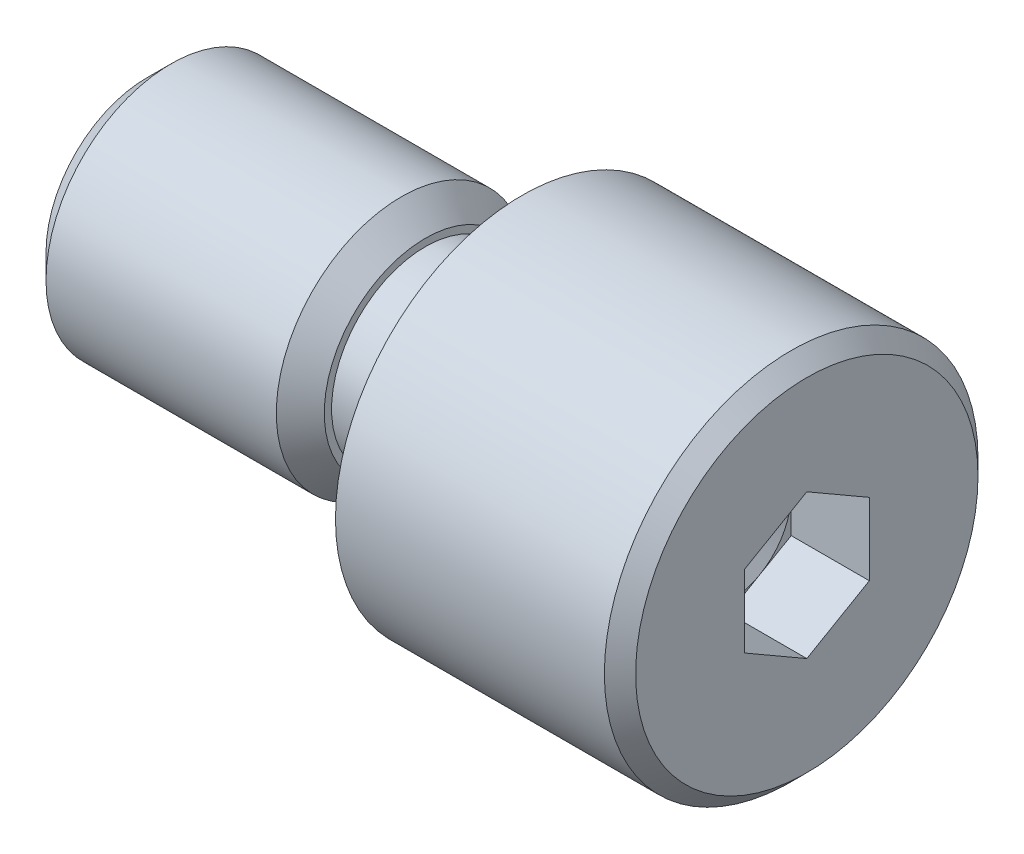
ISO-10303-21;
HEADER;
FILE_DESCRIPTION(('STEP AP214'),'2;1');
FILE_NAME('part.step','',(''),(''),'','','');
FILE_SCHEMA(('AUTOMOTIVE_DESIGN { 1 0 10303 214 1 1 1 1 }'));
ENDSEC;
DATA;
#1=APPLICATION_CONTEXT('core data for automotive mechanical design processes');
#2=APPLICATION_PROTOCOL_DEFINITION('international standard','automotive_design',2000,#1);
#3=PRODUCT_CONTEXT('',#1,'mechanical');
#4=PRODUCT('Part','Part','',(#3));
#5=PRODUCT_RELATED_PRODUCT_CATEGORY('part','',(#4));
#6=PRODUCT_DEFINITION_FORMATION('','',#4);
#7=PRODUCT_DEFINITION_CONTEXT('part definition',#1,'design');
#8=PRODUCT_DEFINITION('design','',#6,#7);
#9=PRODUCT_DEFINITION_SHAPE('','',#8);
#10=(LENGTH_UNIT() NAMED_UNIT(*) SI_UNIT(.MILLI.,.METRE.));
#11=(NAMED_UNIT(*) PLANE_ANGLE_UNIT() SI_UNIT($,.RADIAN.));
#12=(NAMED_UNIT(*) SI_UNIT($,.STERADIAN.) SOLID_ANGLE_UNIT());
#13=UNCERTAINTY_MEASURE_WITH_UNIT(LENGTH_MEASURE(1.E-05),#10,'distance_accuracy_value','');
#14=(GEOMETRIC_REPRESENTATION_CONTEXT(3) GLOBAL_UNCERTAINTY_ASSIGNED_CONTEXT((#13)) GLOBAL_UNIT_ASSIGNED_CONTEXT((#10,
#11,#12)) REPRESENTATION_CONTEXT('',''));
#15=CARTESIAN_POINT('',(0.,0.,0.));
#16=DIRECTION('',(0.,0.,1.));
#17=DIRECTION('',(1.,0.,0.));
#18=AXIS2_PLACEMENT_3D('',#15,#16,#17);
#19=CARTESIAN_POINT('',(18.6,0.,0.));
#20=DIRECTION('',(1.,0.,0.));
#21=DIRECTION('',(0.,0.,-1.));
#22=AXIS2_PLACEMENT_3D('',#19,#20,#21);
#23=PLANE('',#22);
#24=DIRECTION('',(0.,-1.,0.));
#25=VECTOR('',#24,1.);
#26=CARTESIAN_POINT('',(18.6,1.1547005383793,2.));
#27=LINE('',#26,#25);
#28=CARTESIAN_POINT('',(18.6,1.1547005383793,2.));
#29=VERTEX_POINT('',#28);
#30=CARTESIAN_POINT('',(18.6000000000002,0.,2.));
#31=VERTEX_POINT('',#30);
#32=EDGE_CURVE('E266',#29,#31,#27,.T.);
#33=ORIENTED_EDGE('',*,*,#32,.T.);
#34=CARTESIAN_POINT('',(18.6000000000002,0.,0.));
#35=DIRECTION('',(-1.,0.,0.));
#36=DIRECTION('',(0.,0.,1.));
#37=AXIS2_PLACEMENT_3D('',#34,#35,#36);
#38=CIRCLE('',#37,1.99999999999989);
#39=CARTESIAN_POINT('',(18.6000000000002,1.7320508075688,0.999999999999912));
#40=VERTEX_POINT('',#39);
#41=EDGE_CURVE('E51',#31,#40,#38,.T.);
#42=ORIENTED_EDGE('',*,*,#41,.T.);
#43=DIRECTION('',(0.,-0.499999999999983,0.866025403784448));
#44=VECTOR('',#43,1.);
#45=CARTESIAN_POINT('',(18.6,2.3094010767585,0.));
#46=LINE('',#45,#44);
#47=EDGE_CURVE('E298',#40,#29,#46,.T.);
#48=ORIENTED_EDGE('',*,*,#47,.T.);
#49=EDGE_LOOP('',(#33,#42,#48));
#50=FACE_BOUND('',#49,.T.);
#51=ADVANCED_FACE('F36',(#50),#23,.T.);
#52=CARTESIAN_POINT('',(18.6,2.3094010767585,0.));
#53=VERTEX_POINT('',#52);
#54=EDGE_CURVE('E294',#53,#40,#46,.T.);
#55=ORIENTED_EDGE('',*,*,#54,.T.);
#56=CARTESIAN_POINT('',(18.6000000000002,1.7320508075688,-0.999999999999912));
#57=VERTEX_POINT('',#56);
#58=EDGE_CURVE('E239',#40,#57,#38,.T.);
#59=ORIENTED_EDGE('',*,*,#58,.T.);
#60=DIRECTION('',(0.,0.499999999999983,0.866025403784448));
#61=VECTOR('',#60,1.);
#62=CARTESIAN_POINT('',(18.6,1.1547005383793,-2.));
#63=LINE('',#62,#61);
#64=EDGE_CURVE('E304',#57,#53,#63,.T.);
#65=ORIENTED_EDGE('',*,*,#64,.T.);
#66=EDGE_LOOP('',(#55,#59,#65));
#67=FACE_BOUND('',#66,.T.);
#68=ADVANCED_FACE('F126',(#67),#23,.T.);
#69=CARTESIAN_POINT('',(18.6,1.1547005383793,-2.));
#70=VERTEX_POINT('',#69);
#71=EDGE_CURVE('E300',#70,#57,#63,.T.);
#72=ORIENTED_EDGE('',*,*,#71,.T.);
#73=CARTESIAN_POINT('',(18.6000000000002,0.,-1.99999999999989));
#74=VERTEX_POINT('',#73);
#75=EDGE_CURVE('E253',#57,#74,#38,.T.);
#76=ORIENTED_EDGE('',*,*,#75,.T.);
#77=DIRECTION('',(0.,1.,0.));
#78=VECTOR('',#77,1.);
#79=CARTESIAN_POINT('',(18.6,-1.1547005383793,-2.));
#80=LINE('',#79,#78);
#81=EDGE_CURVE('E308',#74,#70,#80,.T.);
#82=ORIENTED_EDGE('',*,*,#81,.T.);
#83=EDGE_LOOP('',(#72,#76,#82));
#84=FACE_BOUND('',#83,.T.);
#85=ADVANCED_FACE('F131',(#84),#23,.T.);
#86=CARTESIAN_POINT('',(18.6,-1.1547005383793,-2.));
#87=VERTEX_POINT('',#86);
#88=EDGE_CURVE('E305',#87,#74,#80,.T.);
#89=ORIENTED_EDGE('',*,*,#88,.T.);
#90=CARTESIAN_POINT('',(18.6000000000002,-1.7320508075688,-0.999999999999912));
#91=VERTEX_POINT('',#90);
#92=EDGE_CURVE('E257',#74,#91,#38,.T.);
#93=ORIENTED_EDGE('',*,*,#92,.T.);
#94=DIRECTION('',(0.,0.499999999999983,-0.866025403784448));
#95=VECTOR('',#94,1.);
#96=CARTESIAN_POINT('',(18.6,-2.3094010767585,0.));
#97=LINE('',#96,#95);
#98=EDGE_CURVE('E311',#91,#87,#97,.T.);
#99=ORIENTED_EDGE('',*,*,#98,.T.);
#100=EDGE_LOOP('',(#89,#93,#99));
#101=FACE_BOUND('',#100,.T.);
#102=ADVANCED_FACE('F322',(#101),#23,.T.);
#103=CARTESIAN_POINT('',(18.6,-2.3094010767585,0.));
#104=VERTEX_POINT('',#103);
#105=EDGE_CURVE('E309',#104,#91,#97,.T.);
#106=ORIENTED_EDGE('',*,*,#105,.T.);
#107=CARTESIAN_POINT('',(18.6000000000002,-1.7320508075688,0.999999999999912));
#108=VERTEX_POINT('',#107);
#109=EDGE_CURVE('E228',#91,#108,#38,.T.);
#110=ORIENTED_EDGE('',*,*,#109,.T.);
#111=DIRECTION('',(0.,-0.499999999999983,-0.866025403784448));
#112=VECTOR('',#111,1.);
#113=CARTESIAN_POINT('',(18.6,-1.1547005383793,2.));
#114=LINE('',#113,#112);
#115=EDGE_CURVE('E280',#108,#104,#114,.T.);
#116=ORIENTED_EDGE('',*,*,#115,.T.);
#117=EDGE_LOOP('',(#106,#110,#116));
#118=FACE_BOUND('',#117,.T.);
#119=ADVANCED_FACE('F124',(#118),#23,.T.);
#120=CARTESIAN_POINT('',(0.,0.,0.));
#121=DIRECTION('',(1.,0.,0.));
#122=DIRECTION('',(0.,0.,-1.));
#123=AXIS2_PLACEMENT_3D('',#120,#121,#122);
#124=CYLINDRICAL_SURFACE('',#123,4.);
#125=CARTESIAN_POINT('',(0.766999999999996,0.,0.));
#126=DIRECTION('',(-1.,0.,0.));
#127=DIRECTION('',(0.,0.,1.));
#128=AXIS2_PLACEMENT_3D('',#125,#126,#127);
#129=CIRCLE('',#128,4.);
#130=CARTESIAN_POINT('',(0.766999999999996,0.,4.));
#131=VERTEX_POINT('',#130);
#132=EDGE_CURVE('E238',#131,#131,#129,.F.);
#133=ORIENTED_EDGE('',*,*,#132,.T.);
#134=EDGE_LOOP('',(#133));
#135=FACE_BOUND('',#134,.T.);
#136=CARTESIAN_POINT('',(8.133,0.,0.));
#137=DIRECTION('',(1.,0.,0.));
#138=DIRECTION('',(0.,0.,-1.));
#139=AXIS2_PLACEMENT_3D('',#136,#137,#138);
#140=CIRCLE('',#139,4.);
#141=CARTESIAN_POINT('',(8.133,0.,-4.));
#142=VERTEX_POINT('',#141);
#143=EDGE_CURVE('E235',#142,#142,#140,.F.);
#144=ORIENTED_EDGE('',*,*,#143,.T.);
#145=EDGE_LOOP('',(#144));
#146=FACE_BOUND('',#145,.T.);
#147=ADVANCED_FACE('F180',(#135,#146),#124,.T.);
#148=CARTESIAN_POINT('',(0.,4.,0.));
#149=DIRECTION('',(-1.,0.,0.));
#150=DIRECTION('',(0.,0.,1.));
#151=AXIS2_PLACEMENT_3D('',#148,#149,#150);
#152=PLANE('',#151);
#153=CARTESIAN_POINT('',(0.,0.,0.));
#154=DIRECTION('',(-1.,0.,0.));
#155=DIRECTION('',(0.,0.,1.));
#156=AXIS2_PLACEMENT_3D('',#153,#154,#155);
#157=CIRCLE('',#156,3.233);
#158=CARTESIAN_POINT('',(0.,0.,3.233));
#159=VERTEX_POINT('',#158);
#160=EDGE_CURVE('E214',#159,#159,#157,.T.);
#161=ORIENTED_EDGE('',*,*,#160,.T.);
#162=EDGE_LOOP('',(#161));
#163=FACE_BOUND('',#162,.T.);
#164=ADVANCED_FACE('F176',(#163),#152,.T.);
#165=CARTESIAN_POINT('',(21.1,0.,0.));
#166=DIRECTION('',(1.,0.,0.));
#167=DIRECTION('',(0.,0.,-1.));
#168=AXIS2_PLACEMENT_3D('',#165,#166,#167);
#169=PLANE('',#168);
#170=CARTESIAN_POINT('',(21.1,0.,0.));
#171=DIRECTION('',(1.,0.,0.));
#172=DIRECTION('',(0.,0.,-1.));
#173=AXIS2_PLACEMENT_3D('',#170,#171,#172);
#174=CIRCLE('',#173,5.475);
#175=CARTESIAN_POINT('',(21.1,0.,-5.475));
#176=VERTEX_POINT('',#175);
#177=EDGE_CURVE('E209',#176,#176,#174,.T.);
#178=ORIENTED_EDGE('',*,*,#177,.T.);
#179=EDGE_LOOP('',(#178));
#180=FACE_BOUND('',#179,.T.);
#181=DIRECTION('',(0.,-0.499999999999983,-0.866025403784448));
#182=VECTOR('',#181,1.);
#183=CARTESIAN_POINT('',(21.1,-1.1547005383793,2.));
#184=LINE('',#183,#182);
#185=CARTESIAN_POINT('',(21.1,-1.1547005383793,2.));
#186=VERTEX_POINT('',#185);
#187=CARTESIAN_POINT('',(21.1,-2.3094010767585,0.));
#188=VERTEX_POINT('',#187);
#189=EDGE_CURVE('E59',#186,#188,#184,.T.);
#190=ORIENTED_EDGE('',*,*,#189,.F.);
#191=DIRECTION('',(0.,-1.,0.));
#192=VECTOR('',#191,1.);
#193=CARTESIAN_POINT('',(21.1,1.1547005383793,2.));
#194=LINE('',#193,#192);
#195=CARTESIAN_POINT('',(21.1,1.1547005383793,2.));
#196=VERTEX_POINT('',#195);
#197=EDGE_CURVE('E277',#196,#186,#194,.T.);
#198=ORIENTED_EDGE('',*,*,#197,.F.);
#199=DIRECTION('',(0.,-0.499999999999983,0.866025403784448));
#200=VECTOR('',#199,1.);
#201=CARTESIAN_POINT('',(21.1,2.3094010767585,0.));
#202=LINE('',#201,#200);
#203=CARTESIAN_POINT('',(21.1,2.3094010767585,0.));
#204=VERTEX_POINT('',#203);
#205=EDGE_CURVE('E274',#204,#196,#202,.T.);
#206=ORIENTED_EDGE('',*,*,#205,.F.);
#207=DIRECTION('',(0.,0.499999999999983,0.866025403784448));
#208=VECTOR('',#207,1.);
#209=CARTESIAN_POINT('',(21.1,1.1547005383793,-2.));
#210=LINE('',#209,#208);
#211=CARTESIAN_POINT('',(21.1,1.1547005383793,-2.));
#212=VERTEX_POINT('',#211);
#213=EDGE_CURVE('E271',#212,#204,#210,.T.);
#214=ORIENTED_EDGE('',*,*,#213,.F.);
#215=DIRECTION('',(0.,1.,0.));
#216=VECTOR('',#215,1.);
#217=CARTESIAN_POINT('',(21.1,-1.1547005383793,-2.));
#218=LINE('',#217,#216);
#219=CARTESIAN_POINT('',(21.1,-1.1547005383793,-2.));
#220=VERTEX_POINT('',#219);
#221=EDGE_CURVE('E263',#220,#212,#218,.T.);
#222=ORIENTED_EDGE('',*,*,#221,.F.);
#223=DIRECTION('',(0.,0.499999999999983,-0.866025403784448));
#224=VECTOR('',#223,1.);
#225=CARTESIAN_POINT('',(21.1,-2.3094010767585,0.));
#226=LINE('',#225,#224);
#227=EDGE_CURVE('E260',#188,#220,#226,.T.);
#228=ORIENTED_EDGE('',*,*,#227,.F.);
#229=EDGE_LOOP('',(#190,#198,#206,#214,#222,#228));
#230=FACE_BOUND('',#229,.T.);
#231=ADVANCED_FACE('F172',(#180,#230),#169,.T.);
#232=CARTESIAN_POINT('',(0.,0.,0.));
#233=DIRECTION('',(1.,0.,0.));
#234=DIRECTION('',(0.,0.,-1.));
#235=AXIS2_PLACEMENT_3D('',#232,#233,#234);
#236=CYLINDRICAL_SURFACE('',#235,5.975);
#237=CARTESIAN_POINT('',(20.6,0.,0.));
#238=DIRECTION('',(1.,0.,0.));
#239=DIRECTION('',(0.,0.,-1.));
#240=AXIS2_PLACEMENT_3D('',#237,#238,#239);
#241=CIRCLE('',#240,5.975);
#242=CARTESIAN_POINT('',(20.6,0.,-5.975));
#243=VERTEX_POINT('',#242);
#244=EDGE_CURVE('E206',#243,#243,#241,.F.);
#245=ORIENTED_EDGE('',*,*,#244,.T.);
#246=EDGE_LOOP('',(#245));
#247=FACE_BOUND('',#246,.T.);
#248=CARTESIAN_POINT('',(12.,0.,0.));
#249=DIRECTION('',(1.,0.,0.));
#250=DIRECTION('',(0.,0.,-1.));
#251=AXIS2_PLACEMENT_3D('',#248,#249,#250);
#252=CIRCLE('',#251,5.975);
#253=CARTESIAN_POINT('',(12.,0.,-5.975));
#254=VERTEX_POINT('',#253);
#255=EDGE_CURVE('E223',#254,#254,#252,.T.);
#256=ORIENTED_EDGE('',*,*,#255,.T.);
#257=EDGE_LOOP('',(#256));
#258=FACE_BOUND('',#257,.T.);
#259=ADVANCED_FACE('F168',(#247,#258),#236,.T.);
#260=CARTESIAN_POINT('',(12.,5.975,0.));
#261=DIRECTION('',(-1.,0.,0.));
#262=DIRECTION('',(0.,0.,1.));
#263=AXIS2_PLACEMENT_3D('',#260,#261,#262);
#264=PLANE('',#263);
#265=CARTESIAN_POINT('',(12.,0.,0.));
#266=DIRECTION('',(-1.,0.,0.));
#267=DIRECTION('',(0.,0.,1.));
#268=AXIS2_PLACEMENT_3D('',#265,#266,#267);
#269=CIRCLE('',#268,3.20000000000054);
#270=CARTESIAN_POINT('',(12.,0.,3.20000000000054));
#271=VERTEX_POINT('',#270);
#272=EDGE_CURVE('E44',#271,#271,#269,.F.);
#273=ORIENTED_EDGE('',*,*,#272,.T.);
#274=EDGE_LOOP('',(#273));
#275=FACE_BOUND('',#274,.T.);
#276=ORIENTED_EDGE('',*,*,#255,.F.);
#277=EDGE_LOOP('',(#276));
#278=FACE_BOUND('',#277,.T.);
#279=ADVANCED_FACE('F164',(#275,#278),#264,.T.);
#280=CARTESIAN_POINT('',(0.,0.,0.));
#281=DIRECTION('',(1.,0.,0.));
#282=DIRECTION('',(0.,0.,-1.));
#283=AXIS2_PLACEMENT_3D('',#280,#281,#282);
#284=CYLINDRICAL_SURFACE('',#283,3.);
#285=CARTESIAN_POINT('',(11.7999999999995,0.,0.));
#286=DIRECTION('',(-1.,0.,0.));
#287=DIRECTION('',(0.,0.,1.));
#288=AXIS2_PLACEMENT_3D('',#285,#286,#287);
#289=CIRCLE('',#288,3.);
#290=CARTESIAN_POINT('',(11.7999999999995,0.,3.));
#291=VERTEX_POINT('',#290);
#292=EDGE_CURVE('E11',#291,#291,#289,.T.);
#293=ORIENTED_EDGE('',*,*,#292,.T.);
#294=EDGE_LOOP('',(#293));
#295=FACE_BOUND('',#294,.T.);
#296=CARTESIAN_POINT('',(8.9,0.,0.));
#297=DIRECTION('',(1.,0.,0.));
#298=DIRECTION('',(0.,0.,-1.));
#299=AXIS2_PLACEMENT_3D('',#296,#297,#298);
#300=CIRCLE('',#299,3.);
#301=CARTESIAN_POINT('',(8.9,0.,-3.));
#302=VERTEX_POINT('',#301);
#303=EDGE_CURVE('E226',#302,#302,#300,.T.);
#304=ORIENTED_EDGE('',*,*,#303,.T.);
#305=EDGE_LOOP('',(#304));
#306=FACE_BOUND('',#305,.T.);
#307=ADVANCED_FACE('F160',(#295,#306),#284,.T.);
#308=CARTESIAN_POINT('',(8.9,3.,0.));
#309=DIRECTION('',(1.,0.,0.));
#310=DIRECTION('',(0.,0.,-1.));
#311=AXIS2_PLACEMENT_3D('',#308,#309,#310);
#312=PLANE('',#311);
#313=CARTESIAN_POINT('',(8.9,0.,0.));
#314=DIRECTION('',(1.,0.,0.));
#315=DIRECTION('',(0.,0.,-1.));
#316=AXIS2_PLACEMENT_3D('',#313,#314,#315);
#317=CIRCLE('',#316,3.23300000000001);
#318=CARTESIAN_POINT('',(8.9,0.,-3.23300000000001));
#319=VERTEX_POINT('',#318);
#320=EDGE_CURVE('E210',#319,#319,#317,.T.);
#321=ORIENTED_EDGE('',*,*,#320,.T.);
#322=EDGE_LOOP('',(#321));
#323=FACE_BOUND('',#322,.T.);
#324=ORIENTED_EDGE('',*,*,#303,.F.);
#325=EDGE_LOOP('',(#324));
#326=FACE_BOUND('',#325,.T.);
#327=ADVANCED_FACE('F157',(#323,#326),#312,.T.);
#328=CARTESIAN_POINT('',(18.6,-1.1547005383793,2.));
#329=DIRECTION('',(0.,-0.866025403784448,0.499999999999983));
#330=DIRECTION('',(0.,-0.499999999999983,-0.866025403784448));
#331=AXIS2_PLACEMENT_3D('',#328,#329,#330);
#332=PLANE('',#331);
#333=ORIENTED_EDGE('',*,*,#189,.T.);
#334=DIRECTION('',(1.,0.,0.));
#335=VECTOR('',#334,1.);
#336=CARTESIAN_POINT('',(18.6,-2.3094010767585,0.));
#337=LINE('',#336,#335);
#338=EDGE_CURVE('E289',#104,#188,#337,.T.);
#339=ORIENTED_EDGE('',*,*,#338,.F.);
#340=ORIENTED_EDGE('',*,*,#115,.F.);
#341=CARTESIAN_POINT('',(18.6,-1.1547005383793,2.));
#342=VERTEX_POINT('',#341);
#343=EDGE_CURVE('E312',#342,#108,#114,.T.);
#344=ORIENTED_EDGE('',*,*,#343,.F.);
#345=DIRECTION('',(1.,0.,0.));
#346=VECTOR('',#345,1.);
#347=CARTESIAN_POINT('',(18.6,-1.1547005383793,2.));
#348=LINE('',#347,#346);
#349=EDGE_CURVE('E231',#342,#186,#348,.T.);
#350=ORIENTED_EDGE('',*,*,#349,.T.);
#351=EDGE_LOOP('',(#333,#339,#340,#344,#350));
#352=FACE_BOUND('',#351,.T.);
#353=ADVANCED_FACE('F139',(#352),#332,.F.);
#354=CARTESIAN_POINT('',(18.6,1.1547005383793,2.));
#355=DIRECTION('',(0.,0.,1.));
#356=DIRECTION('',(0.,-1.,0.));
#357=AXIS2_PLACEMENT_3D('',#354,#355,#356);
#358=PLANE('',#357);
#359=ORIENTED_EDGE('',*,*,#197,.T.);
#360=ORIENTED_EDGE('',*,*,#349,.F.);
#361=EDGE_CURVE('E292',#31,#342,#27,.T.);
#362=ORIENTED_EDGE('',*,*,#361,.F.);
#363=ORIENTED_EDGE('',*,*,#32,.F.);
#364=DIRECTION('',(1.,0.,0.));
#365=VECTOR('',#364,1.);
#366=CARTESIAN_POINT('',(18.6,1.1547005383793,2.));
#367=LINE('',#366,#365);
#368=EDGE_CURVE('E282',#29,#196,#367,.T.);
#369=ORIENTED_EDGE('',*,*,#368,.T.);
#370=EDGE_LOOP('',(#359,#360,#362,#363,#369));
#371=FACE_BOUND('',#370,.T.);
#372=ADVANCED_FACE('F135',(#371),#358,.F.);
#373=CARTESIAN_POINT('',(18.6,2.3094010767585,0.));
#374=DIRECTION('',(0.,0.866025403784448,0.499999999999983));
#375=DIRECTION('',(0.,-0.499999999999983,0.866025403784448));
#376=AXIS2_PLACEMENT_3D('',#373,#374,#375);
#377=PLANE('',#376);
#378=ORIENTED_EDGE('',*,*,#205,.T.);
#379=ORIENTED_EDGE('',*,*,#368,.F.);
#380=ORIENTED_EDGE('',*,*,#47,.F.);
#381=ORIENTED_EDGE('',*,*,#54,.F.);
#382=DIRECTION('',(1.,0.,0.));
#383=VECTOR('',#382,1.);
#384=CARTESIAN_POINT('',(18.6,2.3094010767585,0.));
#385=LINE('',#384,#383);
#386=EDGE_CURVE('E284',#53,#204,#385,.T.);
#387=ORIENTED_EDGE('',*,*,#386,.T.);
#388=EDGE_LOOP('',(#378,#379,#380,#381,#387));
#389=FACE_BOUND('',#388,.T.);
#390=ADVANCED_FACE('F138',(#389),#377,.F.);
#391=CARTESIAN_POINT('',(18.6,1.1547005383793,-2.));
#392=DIRECTION('',(0.,0.866025403784448,-0.499999999999983));
#393=DIRECTION('',(0.,0.499999999999983,0.866025403784448));
#394=AXIS2_PLACEMENT_3D('',#391,#392,#393);
#395=PLANE('',#394);
#396=ORIENTED_EDGE('',*,*,#213,.T.);
#397=ORIENTED_EDGE('',*,*,#386,.F.);
#398=ORIENTED_EDGE('',*,*,#64,.F.);
#399=ORIENTED_EDGE('',*,*,#71,.F.);
#400=DIRECTION('',(1.,0.,0.));
#401=VECTOR('',#400,1.);
#402=CARTESIAN_POINT('',(18.6,1.1547005383793,-2.));
#403=LINE('',#402,#401);
#404=EDGE_CURVE('E286',#70,#212,#403,.T.);
#405=ORIENTED_EDGE('',*,*,#404,.T.);
#406=EDGE_LOOP('',(#396,#397,#398,#399,#405));
#407=FACE_BOUND('',#406,.T.);
#408=ADVANCED_FACE('F143',(#407),#395,.F.);
#409=CARTESIAN_POINT('',(18.6,-1.1547005383793,-2.));
#410=DIRECTION('',(0.,0.,-1.));
#411=DIRECTION('',(0.,1.,0.));
#412=AXIS2_PLACEMENT_3D('',#409,#410,#411);
#413=PLANE('',#412);
#414=ORIENTED_EDGE('',*,*,#221,.T.);
#415=ORIENTED_EDGE('',*,*,#404,.F.);
#416=ORIENTED_EDGE('',*,*,#81,.F.);
#417=ORIENTED_EDGE('',*,*,#88,.F.);
#418=DIRECTION('',(1.,0.,0.));
#419=VECTOR('',#418,1.);
#420=CARTESIAN_POINT('',(18.6,-1.1547005383793,-2.));
#421=LINE('',#420,#419);
#422=EDGE_CURVE('E288',#87,#220,#421,.T.);
#423=ORIENTED_EDGE('',*,*,#422,.T.);
#424=EDGE_LOOP('',(#414,#415,#416,#417,#423));
#425=FACE_BOUND('',#424,.T.);
#426=ADVANCED_FACE('F147',(#425),#413,.F.);
#427=CARTESIAN_POINT('',(18.6,-2.3094010767585,0.));
#428=DIRECTION('',(0.,-0.866025403784448,-0.499999999999983));
#429=DIRECTION('',(0.,0.499999999999983,-0.866025403784448));
#430=AXIS2_PLACEMENT_3D('',#427,#428,#429);
#431=PLANE('',#430);
#432=ORIENTED_EDGE('',*,*,#227,.T.);
#433=ORIENTED_EDGE('',*,*,#422,.F.);
#434=ORIENTED_EDGE('',*,*,#98,.F.);
#435=ORIENTED_EDGE('',*,*,#105,.F.);
#436=ORIENTED_EDGE('',*,*,#338,.T.);
#437=EDGE_LOOP('',(#432,#433,#434,#435,#436));
#438=FACE_BOUND('',#437,.T.);
#439=ADVANCED_FACE('F121',(#438),#431,.F.);
#440=ORIENTED_EDGE('',*,*,#343,.T.);
#441=EDGE_CURVE('E225',#108,#31,#38,.T.);
#442=ORIENTED_EDGE('',*,*,#441,.T.);
#443=ORIENTED_EDGE('',*,*,#361,.T.);
#444=EDGE_LOOP('',(#440,#442,#443));
#445=FACE_BOUND('',#444,.T.);
#446=ADVANCED_FACE('F112',(#445),#23,.T.);
#447=CARTESIAN_POINT('',(17.445299461621,0.,0.));
#448=DIRECTION('',(1.,0.,0.));
#449=DIRECTION('',(0.,0.,-1.));
#450=AXIS2_PLACEMENT_3D('',#447,#448,#449);
#451=CONICAL_SURFACE('',#450,0.,1.0471975511966);
#452=ORIENTED_EDGE('',*,*,#41,.F.);
#453=ORIENTED_EDGE('',*,*,#441,.F.);
#454=ORIENTED_EDGE('',*,*,#109,.F.);
#455=ORIENTED_EDGE('',*,*,#92,.F.);
#456=ORIENTED_EDGE('',*,*,#75,.F.);
#457=ORIENTED_EDGE('',*,*,#58,.F.);
#458=EDGE_LOOP('',(#452,#453,#454,#455,#456,#457));
#459=FACE_BOUND('',#458,.T.);
#460=CARTESIAN_POINT('',(17.445299461621,0.,0.));
#461=VERTEX_POINT('',#460);
#462=VERTEX_LOOP('',#461);
#463=FACE_BOUND('',#462,.T.);
#464=ADVANCED_FACE('F109',(#459,#463),#451,.F.);
#465=CARTESIAN_POINT('',(0.766999999999996,0.,0.));
#466=DIRECTION('',(1.,0.,0.));
#467=DIRECTION('',(0.,0.,-1.));
#468=AXIS2_PLACEMENT_3D('',#465,#466,#467);
#469=CONICAL_SURFACE('',#468,4.,0.785398163397451);
#470=ORIENTED_EDGE('',*,*,#160,.F.);
#471=EDGE_LOOP('',(#470));
#472=FACE_BOUND('',#471,.T.);
#473=ORIENTED_EDGE('',*,*,#132,.F.);
#474=EDGE_LOOP('',(#473));
#475=FACE_BOUND('',#474,.T.);
#476=ADVANCED_FACE('F111',(#472,#475),#469,.T.);
#477=CARTESIAN_POINT('',(8.9,0.,0.));
#478=DIRECTION('',(-1.,0.,0.));
#479=DIRECTION('',(0.,0.,1.));
#480=AXIS2_PLACEMENT_3D('',#477,#478,#479);
#481=CONICAL_SURFACE('',#480,3.23300000000001,0.785398163397446);
#482=ORIENTED_EDGE('',*,*,#143,.F.);
#483=EDGE_LOOP('',(#482));
#484=FACE_BOUND('',#483,.T.);
#485=ORIENTED_EDGE('',*,*,#320,.F.);
#486=EDGE_LOOP('',(#485));
#487=FACE_BOUND('',#486,.T.);
#488=ADVANCED_FACE('F118',(#484,#487),#481,.T.);
#489=CARTESIAN_POINT('',(21.1,0.,0.));
#490=DIRECTION('',(-1.,0.,0.));
#491=DIRECTION('',(0.,0.,1.));
#492=AXIS2_PLACEMENT_3D('',#489,#490,#491);
#493=CONICAL_SURFACE('',#492,5.475,0.785398163397445);
#494=ORIENTED_EDGE('',*,*,#244,.F.);
#495=EDGE_LOOP('',(#494));
#496=FACE_BOUND('',#495,.T.);
#497=ORIENTED_EDGE('',*,*,#177,.F.);
#498=EDGE_LOOP('',(#497));
#499=FACE_BOUND('',#498,.T.);
#500=ADVANCED_FACE('F193',(#496,#499),#493,.T.);
#501=CARTESIAN_POINT('',(11.7999999999995,0.,0.));
#502=DIRECTION('',(-1.,0.,0.));
#503=DIRECTION('',(0.,0.,1.));
#504=AXIS2_PLACEMENT_3D('',#501,#502,#503);
#505=TOROIDAL_SURFACE('',#504,3.20000000000054,0.200000000000544);
#506=ORIENTED_EDGE('',*,*,#292,.F.);
#507=EDGE_LOOP('',(#506));
#508=FACE_BOUND('',#507,.T.);
#509=ORIENTED_EDGE('',*,*,#272,.F.);
#510=EDGE_LOOP('',(#509));
#511=FACE_BOUND('',#510,.T.);
#512=ADVANCED_FACE('F38',(#508,#511),#505,.F.);
#513=CLOSED_SHELL('',(#51,#68,#85,#102,#119,#147,#164,#231,#259,#279,#307,#327,#353,#372,#390,
#408,#426,#439,#446,#464,#476,#488,#500,#512));
#514=MANIFOLD_SOLID_BREP('B2',#513);
#515=ADVANCED_BREP_SHAPE_REPRESENTATION('',(#18,#514),#14);
#516=SHAPE_DEFINITION_REPRESENTATION(#9,#515);
ENDSEC;
END-ISO-10303-21;
